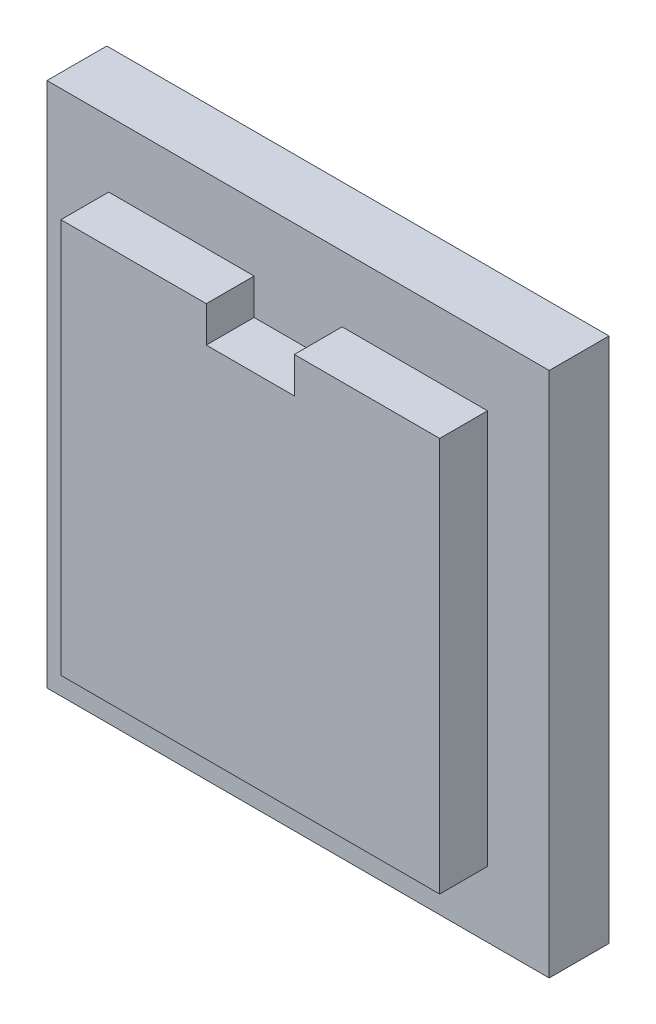
ISO-10303-21;
HEADER;
FILE_DESCRIPTION(('STEP AP214'),'2;1');
FILE_NAME('part.step','',(''),(''),'','','');
FILE_SCHEMA(('AUTOMOTIVE_DESIGN { 1 0 10303 214 1 1 1 1 }'));
ENDSEC;
DATA;
#1=APPLICATION_CONTEXT('core data for automotive mechanical design processes');
#2=APPLICATION_PROTOCOL_DEFINITION('international standard','automotive_design',2000,#1);
#3=PRODUCT_CONTEXT('',#1,'mechanical');
#4=PRODUCT('Part','Part','',(#3));
#5=PRODUCT_RELATED_PRODUCT_CATEGORY('part','',(#4));
#6=PRODUCT_DEFINITION_FORMATION('','',#4);
#7=PRODUCT_DEFINITION_CONTEXT('part definition',#1,'design');
#8=PRODUCT_DEFINITION('design','',#6,#7);
#9=PRODUCT_DEFINITION_SHAPE('','',#8);
#10=(LENGTH_UNIT() NAMED_UNIT(*) SI_UNIT(.MILLI.,.METRE.));
#11=(NAMED_UNIT(*) PLANE_ANGLE_UNIT() SI_UNIT($,.RADIAN.));
#12=(NAMED_UNIT(*) SI_UNIT($,.STERADIAN.) SOLID_ANGLE_UNIT());
#13=UNCERTAINTY_MEASURE_WITH_UNIT(LENGTH_MEASURE(1.E-05),#10,'distance_accuracy_value','');
#14=(GEOMETRIC_REPRESENTATION_CONTEXT(3) GLOBAL_UNCERTAINTY_ASSIGNED_CONTEXT((#13)) GLOBAL_UNIT_ASSIGNED_CONTEXT((#10,
#11,#12)) REPRESENTATION_CONTEXT('',''));
#15=CARTESIAN_POINT('',(0.,0.,0.));
#16=DIRECTION('',(0.,0.,1.));
#17=DIRECTION('',(1.,0.,0.));
#18=AXIS2_PLACEMENT_3D('',#15,#16,#17);
#19=CARTESIAN_POINT('',(5.842,26.19375,6.35));
#20=DIRECTION('',(0.,-1.,0.));
#21=DIRECTION('',(0.,0.,-1.));
#22=AXIS2_PLACEMENT_3D('',#19,#20,#21);
#23=PLANE('',#22);
#24=DIRECTION('',(-1.,0.,0.));
#25=VECTOR('',#24,1.);
#26=CARTESIAN_POINT('',(5.842,26.19375,0.));
#27=LINE('',#26,#25);
#28=CARTESIAN_POINT('',(25.146,26.19375,0.));
#29=VERTEX_POINT('',#28);
#30=CARTESIAN_POINT('',(5.842,26.19375,0.));
#31=VERTEX_POINT('',#30);
#32=EDGE_CURVE('E85',#29,#31,#27,.T.);
#33=ORIENTED_EDGE('',*,*,#32,.T.);
#34=DIRECTION('',(0.,0.,-1.));
#35=VECTOR('',#34,1.);
#36=CARTESIAN_POINT('',(5.842,26.19375,6.35));
#37=LINE('',#36,#35);
#38=CARTESIAN_POINT('',(5.842,26.19375,6.35));
#39=VERTEX_POINT('',#38);
#40=EDGE_CURVE('E11',#39,#31,#37,.T.);
#41=ORIENTED_EDGE('',*,*,#40,.F.);
#42=DIRECTION('',(-1.,0.,0.));
#43=VECTOR('',#42,1.);
#44=CARTESIAN_POINT('',(15.494,26.19375,6.35));
#45=LINE('',#44,#43);
#46=CARTESIAN_POINT('',(25.146,26.19375,6.35));
#47=VERTEX_POINT('',#46);
#48=EDGE_CURVE('E161',#47,#39,#45,.T.);
#49=ORIENTED_EDGE('',*,*,#48,.F.);
#50=DIRECTION('',(0.,0.,-1.));
#51=VECTOR('',#50,1.);
#52=CARTESIAN_POINT('',(25.146,26.19375,6.35));
#53=LINE('',#52,#51);
#54=EDGE_CURVE('E133',#47,#29,#53,.T.);
#55=ORIENTED_EDGE('',*,*,#54,.T.);
#56=EDGE_LOOP('',(#33,#41,#49,#55));
#57=FACE_BOUND('',#56,.T.);
#58=ADVANCED_FACE('F39',(#57),#23,.F.);
#59=CARTESIAN_POINT('',(5.842,21.43125,6.35));
#60=DIRECTION('',(1.,0.,0.));
#61=DIRECTION('',(0.,1.,0.));
#62=AXIS2_PLACEMENT_3D('',#59,#60,#61);
#63=PLANE('',#62);
#64=DIRECTION('',(0.,-1.,0.));
#65=VECTOR('',#64,1.);
#66=CARTESIAN_POINT('',(5.842,21.43125,0.));
#67=LINE('',#66,#65);
#68=CARTESIAN_POINT('',(5.842,21.43125,0.));
#69=VERTEX_POINT('',#68);
#70=EDGE_CURVE('E139',#31,#69,#67,.T.);
#71=ORIENTED_EDGE('',*,*,#70,.T.);
#72=DIRECTION('',(0.,0.,-1.));
#73=VECTOR('',#72,1.);
#74=CARTESIAN_POINT('',(5.842,21.43125,6.35));
#75=LINE('',#74,#73);
#76=CARTESIAN_POINT('',(5.842,21.43125,6.35));
#77=VERTEX_POINT('',#76);
#78=EDGE_CURVE('E47',#77,#69,#75,.T.);
#79=ORIENTED_EDGE('',*,*,#78,.F.);
#80=DIRECTION('',(0.,-1.,0.));
#81=VECTOR('',#80,1.);
#82=CARTESIAN_POINT('',(5.842,21.43125,6.35));
#83=LINE('',#82,#81);
#84=EDGE_CURVE('E188',#39,#77,#83,.T.);
#85=ORIENTED_EDGE('',*,*,#84,.F.);
#86=ORIENTED_EDGE('',*,*,#40,.T.);
#87=EDGE_LOOP('',(#71,#79,#85,#86));
#88=FACE_BOUND('',#87,.T.);
#89=ADVANCED_FACE('F187',(#88),#63,.F.);
#90=CARTESIAN_POINT('',(-5.842,21.43125,6.35));
#91=DIRECTION('',(0.,-1.,0.));
#92=DIRECTION('',(0.,0.,-1.));
#93=AXIS2_PLACEMENT_3D('',#90,#91,#92);
#94=PLANE('',#93);
#95=DIRECTION('',(-1.,0.,0.));
#96=VECTOR('',#95,1.);
#97=CARTESIAN_POINT('',(-5.842,21.43125,0.));
#98=LINE('',#97,#96);
#99=CARTESIAN_POINT('',(-5.842,21.43125,0.));
#100=VERTEX_POINT('',#99);
#101=EDGE_CURVE('E76',#69,#100,#98,.T.);
#102=ORIENTED_EDGE('',*,*,#101,.T.);
#103=DIRECTION('',(0.,0.,-1.));
#104=VECTOR('',#103,1.);
#105=CARTESIAN_POINT('',(-5.842,21.43125,6.35));
#106=LINE('',#105,#104);
#107=CARTESIAN_POINT('',(-5.842,21.43125,6.35));
#108=VERTEX_POINT('',#107);
#109=EDGE_CURVE('E173',#108,#100,#106,.T.);
#110=ORIENTED_EDGE('',*,*,#109,.F.);
#111=DIRECTION('',(-1.,0.,0.));
#112=VECTOR('',#111,1.);
#113=CARTESIAN_POINT('',(-5.842,21.43125,6.35));
#114=LINE('',#113,#112);
#115=EDGE_CURVE('E184',#77,#108,#114,.T.);
#116=ORIENTED_EDGE('',*,*,#115,.F.);
#117=ORIENTED_EDGE('',*,*,#78,.T.);
#118=EDGE_LOOP('',(#102,#110,#116,#117));
#119=FACE_BOUND('',#118,.T.);
#120=ADVANCED_FACE('F181',(#119),#94,.F.);
#121=CARTESIAN_POINT('',(-5.842,26.19375,6.35));
#122=DIRECTION('',(-1.,0.,0.));
#123=DIRECTION('',(0.,-1.,0.));
#124=AXIS2_PLACEMENT_3D('',#121,#122,#123);
#125=PLANE('',#124);
#126=DIRECTION('',(0.,1.,0.));
#127=VECTOR('',#126,1.);
#128=CARTESIAN_POINT('',(-5.842,26.19375,0.));
#129=LINE('',#128,#127);
#130=CARTESIAN_POINT('',(-5.842,26.19375,0.));
#131=VERTEX_POINT('',#130);
#132=EDGE_CURVE('E145',#100,#131,#129,.T.);
#133=ORIENTED_EDGE('',*,*,#132,.T.);
#134=DIRECTION('',(0.,0.,-1.));
#135=VECTOR('',#134,1.);
#136=CARTESIAN_POINT('',(-5.842,26.19375,6.35));
#137=LINE('',#136,#135);
#138=CARTESIAN_POINT('',(-5.842,26.19375,6.35));
#139=VERTEX_POINT('',#138);
#140=EDGE_CURVE('E169',#139,#131,#137,.T.);
#141=ORIENTED_EDGE('',*,*,#140,.F.);
#142=DIRECTION('',(0.,1.,0.));
#143=VECTOR('',#142,1.);
#144=CARTESIAN_POINT('',(-5.842,26.19375,6.35));
#145=LINE('',#144,#143);
#146=EDGE_CURVE('E417',#108,#139,#145,.T.);
#147=ORIENTED_EDGE('',*,*,#146,.F.);
#148=ORIENTED_EDGE('',*,*,#109,.T.);
#149=EDGE_LOOP('',(#133,#141,#147,#148));
#150=FACE_BOUND('',#149,.T.);
#151=ADVANCED_FACE('F423',(#150),#125,.F.);
#152=CARTESIAN_POINT('',(-25.146,26.19375,6.35));
#153=DIRECTION('',(0.,-1.,0.));
#154=DIRECTION('',(0.,0.,-1.));
#155=AXIS2_PLACEMENT_3D('',#152,#153,#154);
#156=PLANE('',#155);
#157=DIRECTION('',(-1.,0.,0.));
#158=VECTOR('',#157,1.);
#159=CARTESIAN_POINT('',(-25.146,26.19375,0.));
#160=LINE('',#159,#158);
#161=CARTESIAN_POINT('',(-25.146,26.19375,0.));
#162=VERTEX_POINT('',#161);
#163=EDGE_CURVE('E149',#131,#162,#160,.T.);
#164=ORIENTED_EDGE('',*,*,#163,.T.);
#165=DIRECTION('',(0.,0.,-1.));
#166=VECTOR('',#165,1.);
#167=CARTESIAN_POINT('',(-25.146,26.19375,6.35));
#168=LINE('',#167,#166);
#169=CARTESIAN_POINT('',(-25.146,26.19375,6.35));
#170=VERTEX_POINT('',#169);
#171=EDGE_CURVE('E125',#170,#162,#168,.T.);
#172=ORIENTED_EDGE('',*,*,#171,.F.);
#173=DIRECTION('',(-1.,0.,0.));
#174=VECTOR('',#173,1.);
#175=CARTESIAN_POINT('',(-15.494,26.19375,6.35));
#176=LINE('',#175,#174);
#177=EDGE_CURVE('E110',#139,#170,#176,.T.);
#178=ORIENTED_EDGE('',*,*,#177,.F.);
#179=ORIENTED_EDGE('',*,*,#140,.T.);
#180=EDGE_LOOP('',(#164,#172,#178,#179));
#181=FACE_BOUND('',#180,.T.);
#182=ADVANCED_FACE('F425',(#181),#156,.F.);
#183=CARTESIAN_POINT('',(-25.146,-26.19375,6.35));
#184=DIRECTION('',(1.,0.,0.));
#185=DIRECTION('',(0.,0.,-1.));
#186=AXIS2_PLACEMENT_3D('',#183,#184,#185);
#187=PLANE('',#186);
#188=DIRECTION('',(0.,-1.,0.));
#189=VECTOR('',#188,1.);
#190=CARTESIAN_POINT('',(-25.146,-26.19375,0.));
#191=LINE('',#190,#189);
#192=CARTESIAN_POINT('',(-25.146,-26.19375,0.));
#193=VERTEX_POINT('',#192);
#194=EDGE_CURVE('E121',#162,#193,#191,.T.);
#195=ORIENTED_EDGE('',*,*,#194,.T.);
#196=DIRECTION('',(0.,0.,-1.));
#197=VECTOR('',#196,1.);
#198=CARTESIAN_POINT('',(-25.146,-26.19375,6.35));
#199=LINE('',#198,#197);
#200=CARTESIAN_POINT('',(-25.146,-26.19375,6.35));
#201=VERTEX_POINT('',#200);
#202=EDGE_CURVE('E118',#201,#193,#199,.T.);
#203=ORIENTED_EDGE('',*,*,#202,.F.);
#204=DIRECTION('',(0.,-1.,0.));
#205=VECTOR('',#204,1.);
#206=CARTESIAN_POINT('',(-25.146,-26.19375,6.35));
#207=LINE('',#206,#205);
#208=EDGE_CURVE('E103',#170,#201,#207,.T.);
#209=ORIENTED_EDGE('',*,*,#208,.F.);
#210=ORIENTED_EDGE('',*,*,#171,.T.);
#211=EDGE_LOOP('',(#195,#203,#209,#210));
#212=FACE_BOUND('',#211,.T.);
#213=ADVANCED_FACE('F119',(#212),#187,.F.);
#214=CARTESIAN_POINT('',(-25.146,-26.19375,6.35));
#215=DIRECTION('',(0.,1.,0.));
#216=DIRECTION('',(0.,0.,1.));
#217=AXIS2_PLACEMENT_3D('',#214,#215,#216);
#218=PLANE('',#217);
#219=DIRECTION('',(1.,0.,0.));
#220=VECTOR('',#219,1.);
#221=CARTESIAN_POINT('',(-25.146,-26.19375,0.));
#222=LINE('',#221,#220);
#223=CARTESIAN_POINT('',(25.146,-26.19375,0.));
#224=VERTEX_POINT('',#223);
#225=EDGE_CURVE('E155',#193,#224,#222,.T.);
#226=ORIENTED_EDGE('',*,*,#225,.T.);
#227=DIRECTION('',(0.,0.,-1.));
#228=VECTOR('',#227,1.);
#229=CARTESIAN_POINT('',(25.146,-26.19375,6.35));
#230=LINE('',#229,#228);
#231=CARTESIAN_POINT('',(25.146,-26.19375,6.35));
#232=VERTEX_POINT('',#231);
#233=EDGE_CURVE('E126',#232,#224,#230,.T.);
#234=ORIENTED_EDGE('',*,*,#233,.F.);
#235=DIRECTION('',(1.,0.,0.));
#236=VECTOR('',#235,1.);
#237=CARTESIAN_POINT('',(-25.146,-26.19375,6.35));
#238=LINE('',#237,#236);
#239=EDGE_CURVE('E107',#201,#232,#238,.T.);
#240=ORIENTED_EDGE('',*,*,#239,.F.);
#241=ORIENTED_EDGE('',*,*,#202,.T.);
#242=EDGE_LOOP('',(#226,#234,#240,#241));
#243=FACE_BOUND('',#242,.T.);
#244=ADVANCED_FACE('F128',(#243),#218,.F.);
#245=CARTESIAN_POINT('',(25.146,-26.19375,6.35));
#246=DIRECTION('',(-1.,0.,0.));
#247=DIRECTION('',(0.,0.,1.));
#248=AXIS2_PLACEMENT_3D('',#245,#246,#247);
#249=PLANE('',#248);
#250=DIRECTION('',(0.,1.,0.));
#251=VECTOR('',#250,1.);
#252=CARTESIAN_POINT('',(25.146,-26.19375,0.));
#253=LINE('',#252,#251);
#254=EDGE_CURVE('E158',#224,#29,#253,.T.);
#255=ORIENTED_EDGE('',*,*,#254,.T.);
#256=ORIENTED_EDGE('',*,*,#54,.F.);
#257=DIRECTION('',(0.,1.,0.));
#258=VECTOR('',#257,1.);
#259=CARTESIAN_POINT('',(25.146,-26.19375,6.35));
#260=LINE('',#259,#258);
#261=EDGE_CURVE('E63',#232,#47,#260,.T.);
#262=ORIENTED_EDGE('',*,*,#261,.F.);
#263=ORIENTED_EDGE('',*,*,#233,.T.);
#264=EDGE_LOOP('',(#255,#256,#262,#263));
#265=FACE_BOUND('',#264,.T.);
#266=ADVANCED_FACE('F197',(#265),#249,.F.);
#267=CARTESIAN_POINT('',(0.,0.,6.35));
#268=DIRECTION('',(0.,0.,1.));
#269=DIRECTION('',(1.,0.,0.));
#270=AXIS2_PLACEMENT_3D('',#267,#268,#269);
#271=PLANE('',#270);
#272=ORIENTED_EDGE('',*,*,#48,.T.);
#273=ORIENTED_EDGE('',*,*,#84,.T.);
#274=ORIENTED_EDGE('',*,*,#115,.T.);
#275=ORIENTED_EDGE('',*,*,#146,.T.);
#276=ORIENTED_EDGE('',*,*,#177,.T.);
#277=ORIENTED_EDGE('',*,*,#208,.T.);
#278=ORIENTED_EDGE('',*,*,#239,.T.);
#279=ORIENTED_EDGE('',*,*,#261,.T.);
#280=EDGE_LOOP('',(#272,#273,#274,#275,#276,#277,#278,#279));
#281=FACE_BOUND('',#280,.T.);
#282=ADVANCED_FACE('F105',(#281),#271,.T.);
#283=CARTESIAN_POINT('',(0.,0.,0.));
#284=DIRECTION('',(0.,0.,1.));
#285=DIRECTION('',(1.,0.,0.));
#286=AXIS2_PLACEMENT_3D('',#283,#284,#285);
#287=PLANE('',#286);
#288=DIRECTION('',(0.,-1.,0.));
#289=VECTOR('',#288,1.);
#290=CARTESIAN_POINT('',(-33.3375,-34.925,0.));
#291=LINE('',#290,#289);
#292=CARTESIAN_POINT('',(-33.3375,34.925,0.));
#293=VERTEX_POINT('',#292);
#294=CARTESIAN_POINT('',(-33.3375,-34.925,0.));
#295=VERTEX_POINT('',#294);
#296=EDGE_CURVE('E384',#293,#295,#291,.T.);
#297=ORIENTED_EDGE('',*,*,#296,.T.);
#298=DIRECTION('',(1.,0.,0.));
#299=VECTOR('',#298,1.);
#300=CARTESIAN_POINT('',(33.3375,-34.925,0.));
#301=LINE('',#300,#299);
#302=CARTESIAN_POINT('',(33.3375,-34.925,0.));
#303=VERTEX_POINT('',#302);
#304=EDGE_CURVE('E388',#295,#303,#301,.T.);
#305=ORIENTED_EDGE('',*,*,#304,.T.);
#306=DIRECTION('',(0.,1.,0.));
#307=VECTOR('',#306,1.);
#308=CARTESIAN_POINT('',(33.3375,-34.925,0.));
#309=LINE('',#308,#307);
#310=CARTESIAN_POINT('',(33.3375,34.925,0.));
#311=VERTEX_POINT('',#310);
#312=EDGE_CURVE('E392',#303,#311,#309,.T.);
#313=ORIENTED_EDGE('',*,*,#312,.T.);
#314=DIRECTION('',(-1.,0.,0.));
#315=VECTOR('',#314,1.);
#316=CARTESIAN_POINT('',(33.3375,34.925,0.));
#317=LINE('',#316,#315);
#318=EDGE_CURVE('E396',#311,#293,#317,.T.);
#319=ORIENTED_EDGE('',*,*,#318,.T.);
#320=EDGE_LOOP('',(#297,#305,#313,#319));
#321=FACE_BOUND('',#320,.T.);
#322=ORIENTED_EDGE('',*,*,#32,.F.);
#323=ORIENTED_EDGE('',*,*,#254,.F.);
#324=ORIENTED_EDGE('',*,*,#225,.F.);
#325=ORIENTED_EDGE('',*,*,#194,.F.);
#326=ORIENTED_EDGE('',*,*,#163,.F.);
#327=ORIENTED_EDGE('',*,*,#132,.F.);
#328=ORIENTED_EDGE('',*,*,#101,.F.);
#329=ORIENTED_EDGE('',*,*,#70,.F.);
#330=EDGE_LOOP('',(#322,#323,#324,#325,#326,#327,#328,#329));
#331=FACE_BOUND('',#330,.T.);
#332=ADVANCED_FACE('F191',(#321,#331),#287,.T.);
#333=CARTESIAN_POINT('',(-33.3375,-34.925,-3.175));
#334=DIRECTION('',(-1.,0.,0.));
#335=DIRECTION('',(0.,0.,1.));
#336=AXIS2_PLACEMENT_3D('',#333,#334,#335);
#337=PLANE('',#336);
#338=ORIENTED_EDGE('',*,*,#296,.F.);
#339=DIRECTION('',(0.,0.,1.));
#340=VECTOR('',#339,1.);
#341=CARTESIAN_POINT('',(-33.3375,34.925,-3.175));
#342=LINE('',#341,#340);
#343=CARTESIAN_POINT('',(-33.3375,34.925,-7.9375));
#344=VERTEX_POINT('',#343);
#345=EDGE_CURVE('E140',#344,#293,#342,.T.);
#346=ORIENTED_EDGE('',*,*,#345,.F.);
#347=DIRECTION('',(0.,1.,0.));
#348=VECTOR('',#347,1.);
#349=CARTESIAN_POINT('',(-33.3375,-34.925,-7.9375));
#350=LINE('',#349,#348);
#351=CARTESIAN_POINT('',(-33.3375,-34.925,-7.9375));
#352=VERTEX_POINT('',#351);
#353=EDGE_CURVE('E372',#352,#344,#350,.T.);
#354=ORIENTED_EDGE('',*,*,#353,.F.);
#355=DIRECTION('',(0.,0.,1.));
#356=VECTOR('',#355,1.);
#357=CARTESIAN_POINT('',(-33.3375,-34.925,-3.175));
#358=LINE('',#357,#356);
#359=EDGE_CURVE('E400',#352,#295,#358,.T.);
#360=ORIENTED_EDGE('',*,*,#359,.T.);
#361=EDGE_LOOP('',(#338,#346,#354,#360));
#362=FACE_BOUND('',#361,.T.);
#363=ADVANCED_FACE('F486',(#362),#337,.T.);
#364=CARTESIAN_POINT('',(33.3375,34.925,-3.175));
#365=DIRECTION('',(0.,1.,0.));
#366=DIRECTION('',(-1.,0.,0.));
#367=AXIS2_PLACEMENT_3D('',#364,#365,#366);
#368=PLANE('',#367);
#369=ORIENTED_EDGE('',*,*,#318,.F.);
#370=DIRECTION('',(0.,0.,1.));
#371=VECTOR('',#370,1.);
#372=CARTESIAN_POINT('',(33.3375,34.925,-3.175));
#373=LINE('',#372,#371);
#374=CARTESIAN_POINT('',(33.3375,34.925,-7.9375));
#375=VERTEX_POINT('',#374);
#376=EDGE_CURVE('E403',#375,#311,#373,.T.);
#377=ORIENTED_EDGE('',*,*,#376,.F.);
#378=DIRECTION('',(1.,0.,0.));
#379=VECTOR('',#378,1.);
#380=CARTESIAN_POINT('',(-33.3375,34.925,-7.9375));
#381=LINE('',#380,#379);
#382=EDGE_CURVE('E376',#344,#375,#381,.T.);
#383=ORIENTED_EDGE('',*,*,#382,.F.);
#384=ORIENTED_EDGE('',*,*,#345,.T.);
#385=EDGE_LOOP('',(#369,#377,#383,#384));
#386=FACE_BOUND('',#385,.T.);
#387=ADVANCED_FACE('F497',(#386),#368,.T.);
#388=CARTESIAN_POINT('',(33.3375,-34.925,-3.175));
#389=DIRECTION('',(1.,0.,0.));
#390=DIRECTION('',(0.,0.,-1.));
#391=AXIS2_PLACEMENT_3D('',#388,#389,#390);
#392=PLANE('',#391);
#393=ORIENTED_EDGE('',*,*,#312,.F.);
#394=DIRECTION('',(0.,0.,1.));
#395=VECTOR('',#394,1.);
#396=CARTESIAN_POINT('',(33.3375,-34.925,-3.175));
#397=LINE('',#396,#395);
#398=CARTESIAN_POINT('',(33.3375,-34.925,-7.9375));
#399=VERTEX_POINT('',#398);
#400=EDGE_CURVE('E406',#399,#303,#397,.T.);
#401=ORIENTED_EDGE('',*,*,#400,.F.);
#402=DIRECTION('',(0.,-1.,0.));
#403=VECTOR('',#402,1.);
#404=CARTESIAN_POINT('',(33.3375,34.925,-7.9375));
#405=LINE('',#404,#403);
#406=EDGE_CURVE('E380',#375,#399,#405,.T.);
#407=ORIENTED_EDGE('',*,*,#406,.F.);
#408=ORIENTED_EDGE('',*,*,#376,.T.);
#409=EDGE_LOOP('',(#393,#401,#407,#408));
#410=FACE_BOUND('',#409,.T.);
#411=ADVANCED_FACE('F508',(#410),#392,.T.);
#412=CARTESIAN_POINT('',(33.3375,-34.925,-3.175));
#413=DIRECTION('',(0.,-1.,0.));
#414=DIRECTION('',(1.,0.,0.));
#415=AXIS2_PLACEMENT_3D('',#412,#413,#414);
#416=PLANE('',#415);
#417=ORIENTED_EDGE('',*,*,#304,.F.);
#418=ORIENTED_EDGE('',*,*,#359,.F.);
#419=DIRECTION('',(-1.,0.,0.));
#420=VECTOR('',#419,1.);
#421=CARTESIAN_POINT('',(33.3375,-34.925,-7.9375));
#422=LINE('',#421,#420);
#423=EDGE_CURVE('E293',#399,#352,#422,.T.);
#424=ORIENTED_EDGE('',*,*,#423,.F.);
#425=ORIENTED_EDGE('',*,*,#400,.T.);
#426=EDGE_LOOP('',(#417,#418,#424,#425));
#427=FACE_BOUND('',#426,.T.);
#428=ADVANCED_FACE('F519',(#427),#416,.T.);
#429=CARTESIAN_POINT('',(0.,0.,-7.9375));
#430=DIRECTION('',(0.,0.,-1.));
#431=DIRECTION('',(-1.,0.,0.));
#432=AXIS2_PLACEMENT_3D('',#429,#430,#431);
#433=PLANE('',#432);
#434=ORIENTED_EDGE('',*,*,#423,.T.);
#435=ORIENTED_EDGE('',*,*,#353,.T.);
#436=ORIENTED_EDGE('',*,*,#382,.T.);
#437=ORIENTED_EDGE('',*,*,#406,.T.);
#438=EDGE_LOOP('',(#434,#435,#436,#437));
#439=FACE_BOUND('',#438,.T.);
#440=DIRECTION('',(-1.,0.,0.));
#441=VECTOR('',#440,1.);
#442=CARTESIAN_POINT('',(5.715,-22.733,-7.9375));
#443=LINE('',#442,#441);
#444=CARTESIAN_POINT('',(5.715,-22.733,-7.9375));
#445=VERTEX_POINT('',#444);
#446=CARTESIAN_POINT('',(-5.715,-22.733,-7.9375));
#447=VERTEX_POINT('',#446);
#448=EDGE_CURVE('E284',#445,#447,#443,.T.);
#449=ORIENTED_EDGE('',*,*,#448,.F.);
#450=DIRECTION('',(0.,1.,0.));
#451=VECTOR('',#450,1.);
#452=CARTESIAN_POINT('',(5.715,-27.305,-7.9375));
#453=LINE('',#452,#451);
#454=CARTESIAN_POINT('',(5.715,-27.305,-7.9375));
#455=VERTEX_POINT('',#454);
#456=EDGE_CURVE('E275',#455,#445,#453,.T.);
#457=ORIENTED_EDGE('',*,*,#456,.F.);
#458=DIRECTION('',(-1.,0.,0.));
#459=VECTOR('',#458,1.);
#460=CARTESIAN_POINT('',(24.892,-27.305,-7.9375));
#461=LINE('',#460,#459);
#462=CARTESIAN_POINT('',(24.892,-27.305,-7.9375));
#463=VERTEX_POINT('',#462);
#464=EDGE_CURVE('E318',#463,#455,#461,.T.);
#465=ORIENTED_EDGE('',*,*,#464,.F.);
#466=DIRECTION('',(0.,-1.,0.));
#467=VECTOR('',#466,1.);
#468=CARTESIAN_POINT('',(24.892,-27.305,-7.9375));
#469=LINE('',#468,#467);
#470=CARTESIAN_POINT('',(24.892,27.305,-7.9375));
#471=VERTEX_POINT('',#470);
#472=EDGE_CURVE('E314',#471,#463,#469,.T.);
#473=ORIENTED_EDGE('',*,*,#472,.F.);
#474=DIRECTION('',(1.,0.,0.));
#475=VECTOR('',#474,1.);
#476=CARTESIAN_POINT('',(-5.715,27.305,-7.9375));
#477=LINE('',#476,#475);
#478=CARTESIAN_POINT('',(-24.892,27.305,-7.9375));
#479=VERTEX_POINT('',#478);
#480=EDGE_CURVE('E311',#479,#471,#477,.T.);
#481=ORIENTED_EDGE('',*,*,#480,.F.);
#482=DIRECTION('',(0.,1.,0.));
#483=VECTOR('',#482,1.);
#484=CARTESIAN_POINT('',(-24.892,-27.305,-7.9375));
#485=LINE('',#484,#483);
#486=CARTESIAN_POINT('',(-24.892,-27.305,-7.9375));
#487=VERTEX_POINT('',#486);
#488=EDGE_CURVE('E308',#487,#479,#485,.T.);
#489=ORIENTED_EDGE('',*,*,#488,.F.);
#490=DIRECTION('',(-1.,0.,0.));
#491=VECTOR('',#490,1.);
#492=CARTESIAN_POINT('',(-5.715,-27.305,-7.9375));
#493=LINE('',#492,#491);
#494=CARTESIAN_POINT('',(-5.715,-27.305,-7.9375));
#495=VERTEX_POINT('',#494);
#496=EDGE_CURVE('E303',#495,#487,#493,.T.);
#497=ORIENTED_EDGE('',*,*,#496,.F.);
#498=DIRECTION('',(0.,-1.,0.));
#499=VECTOR('',#498,1.);
#500=CARTESIAN_POINT('',(-5.715,-27.305,-7.9375));
#501=LINE('',#500,#499);
#502=EDGE_CURVE('E299',#447,#495,#501,.T.);
#503=ORIENTED_EDGE('',*,*,#502,.F.);
#504=EDGE_LOOP('',(#449,#457,#465,#473,#481,#489,#497,#503));
#505=FACE_BOUND('',#504,.T.);
#506=ADVANCED_FACE('F297',(#439,#505),#433,.T.);
#507=CARTESIAN_POINT('',(5.715,-27.305,-7.9375));
#508=DIRECTION('',(1.,0.,0.));
#509=DIRECTION('',(0.,0.,-1.));
#510=AXIS2_PLACEMENT_3D('',#507,#508,#509);
#511=PLANE('',#510);
#512=DIRECTION('',(0.,1.,0.));
#513=VECTOR('',#512,1.);
#514=CARTESIAN_POINT('',(5.715,-27.305,-3.175));
#515=LINE('',#514,#513);
#516=CARTESIAN_POINT('',(5.715,-27.305,-3.175));
#517=VERTEX_POINT('',#516);
#518=CARTESIAN_POINT('',(5.715,-22.733,-3.175));
#519=VERTEX_POINT('',#518);
#520=EDGE_CURVE('E321',#517,#519,#515,.T.);
#521=ORIENTED_EDGE('',*,*,#520,.F.);
#522=DIRECTION('',(0.,0.,1.));
#523=VECTOR('',#522,1.);
#524=CARTESIAN_POINT('',(5.715,-27.305,-7.9375));
#525=LINE('',#524,#523);
#526=EDGE_CURVE('E54',#455,#517,#525,.T.);
#527=ORIENTED_EDGE('',*,*,#526,.F.);
#528=ORIENTED_EDGE('',*,*,#456,.T.);
#529=DIRECTION('',(0.,0.,1.));
#530=VECTOR('',#529,1.);
#531=CARTESIAN_POINT('',(5.715,-22.733,-7.9375));
#532=LINE('',#531,#530);
#533=EDGE_CURVE('E278',#445,#519,#532,.T.);
#534=ORIENTED_EDGE('',*,*,#533,.T.);
#535=EDGE_LOOP('',(#521,#527,#528,#534));
#536=FACE_BOUND('',#535,.T.);
#537=ADVANCED_FACE('F277',(#536),#511,.T.);
#538=CARTESIAN_POINT('',(5.715,-22.733,-7.9375));
#539=DIRECTION('',(0.,1.,0.));
#540=DIRECTION('',(0.,0.,1.));
#541=AXIS2_PLACEMENT_3D('',#538,#539,#540);
#542=PLANE('',#541);
#543=DIRECTION('',(-1.,0.,0.));
#544=VECTOR('',#543,1.);
#545=CARTESIAN_POINT('',(5.715,-22.733,-3.175));
#546=LINE('',#545,#544);
#547=CARTESIAN_POINT('',(-5.715,-22.733,-3.175));
#548=VERTEX_POINT('',#547);
#549=EDGE_CURVE('E291',#519,#548,#546,.T.);
#550=ORIENTED_EDGE('',*,*,#549,.F.);
#551=ORIENTED_EDGE('',*,*,#533,.F.);
#552=ORIENTED_EDGE('',*,*,#448,.T.);
#553=DIRECTION('',(0.,0.,1.));
#554=VECTOR('',#553,1.);
#555=CARTESIAN_POINT('',(-5.715,-22.733,-7.9375));
#556=LINE('',#555,#554);
#557=EDGE_CURVE('E294',#447,#548,#556,.T.);
#558=ORIENTED_EDGE('',*,*,#557,.T.);
#559=EDGE_LOOP('',(#550,#551,#552,#558));
#560=FACE_BOUND('',#559,.T.);
#561=ADVANCED_FACE('F288',(#560),#542,.T.);
#562=CARTESIAN_POINT('',(-5.715,-27.305,-7.9375));
#563=DIRECTION('',(-1.,0.,0.));
#564=DIRECTION('',(0.,-1.,0.));
#565=AXIS2_PLACEMENT_3D('',#562,#563,#564);
#566=PLANE('',#565);
#567=DIRECTION('',(0.,-1.,0.));
#568=VECTOR('',#567,1.);
#569=CARTESIAN_POINT('',(-5.715,-27.305,-3.175));
#570=LINE('',#569,#568);
#571=CARTESIAN_POINT('',(-5.715,-27.305,-3.175));
#572=VERTEX_POINT('',#571);
#573=EDGE_CURVE('E326',#548,#572,#570,.T.);
#574=ORIENTED_EDGE('',*,*,#573,.F.);
#575=ORIENTED_EDGE('',*,*,#557,.F.);
#576=ORIENTED_EDGE('',*,*,#502,.T.);
#577=DIRECTION('',(0.,0.,1.));
#578=VECTOR('',#577,1.);
#579=CARTESIAN_POINT('',(-5.715,-27.305,-7.9375));
#580=LINE('',#579,#578);
#581=EDGE_CURVE('E364',#495,#572,#580,.T.);
#582=ORIENTED_EDGE('',*,*,#581,.T.);
#583=EDGE_LOOP('',(#574,#575,#576,#582));
#584=FACE_BOUND('',#583,.T.);
#585=ADVANCED_FACE('F557',(#584),#566,.T.);
#586=CARTESIAN_POINT('',(-5.715,-27.305,-7.9375));
#587=DIRECTION('',(0.,1.,0.));
#588=DIRECTION('',(0.,0.,1.));
#589=AXIS2_PLACEMENT_3D('',#586,#587,#588);
#590=PLANE('',#589);
#591=DIRECTION('',(-1.,0.,0.));
#592=VECTOR('',#591,1.);
#593=CARTESIAN_POINT('',(-5.715,-27.305,-3.175));
#594=LINE('',#593,#592);
#595=CARTESIAN_POINT('',(-24.892,-27.305,-3.175));
#596=VERTEX_POINT('',#595);
#597=EDGE_CURVE('E330',#572,#596,#594,.T.);
#598=ORIENTED_EDGE('',*,*,#597,.F.);
#599=ORIENTED_EDGE('',*,*,#581,.F.);
#600=ORIENTED_EDGE('',*,*,#496,.T.);
#601=DIRECTION('',(0.,0.,1.));
#602=VECTOR('',#601,1.);
#603=CARTESIAN_POINT('',(-24.892,-27.305,-7.9375));
#604=LINE('',#603,#602);
#605=EDGE_CURVE('E361',#487,#596,#604,.T.);
#606=ORIENTED_EDGE('',*,*,#605,.T.);
#607=EDGE_LOOP('',(#598,#599,#600,#606));
#608=FACE_BOUND('',#607,.T.);
#609=ADVANCED_FACE('F566',(#608),#590,.T.);
#610=CARTESIAN_POINT('',(-24.892,-27.305,-7.9375));
#611=DIRECTION('',(1.,0.,0.));
#612=DIRECTION('',(0.,0.,-1.));
#613=AXIS2_PLACEMENT_3D('',#610,#611,#612);
#614=PLANE('',#613);
#615=DIRECTION('',(0.,1.,0.));
#616=VECTOR('',#615,1.);
#617=CARTESIAN_POINT('',(-24.892,-27.305,-3.175));
#618=LINE('',#617,#616);
#619=CARTESIAN_POINT('',(-24.892,27.305,-3.175));
#620=VERTEX_POINT('',#619);
#621=EDGE_CURVE('E334',#596,#620,#618,.T.);
#622=ORIENTED_EDGE('',*,*,#621,.F.);
#623=ORIENTED_EDGE('',*,*,#605,.F.);
#624=ORIENTED_EDGE('',*,*,#488,.T.);
#625=DIRECTION('',(0.,0.,1.));
#626=VECTOR('',#625,1.);
#627=CARTESIAN_POINT('',(-24.892,27.305,-7.9375));
#628=LINE('',#627,#626);
#629=EDGE_CURVE('E357',#479,#620,#628,.T.);
#630=ORIENTED_EDGE('',*,*,#629,.T.);
#631=EDGE_LOOP('',(#622,#623,#624,#630));
#632=FACE_BOUND('',#631,.T.);
#633=ADVANCED_FACE('F576',(#632),#614,.T.);
#634=CARTESIAN_POINT('',(24.892,27.305,-7.9375));
#635=DIRECTION('',(0.,-1.,0.));
#636=DIRECTION('',(0.,0.,-1.));
#637=AXIS2_PLACEMENT_3D('',#634,#635,#636);
#638=PLANE('',#637);
#639=DIRECTION('',(1.,0.,0.));
#640=VECTOR('',#639,1.);
#641=CARTESIAN_POINT('',(24.892,27.305,-3.175));
#642=LINE('',#641,#640);
#643=CARTESIAN_POINT('',(24.892,27.305,-3.175));
#644=VERTEX_POINT('',#643);
#645=EDGE_CURVE('E338',#620,#644,#642,.T.);
#646=ORIENTED_EDGE('',*,*,#645,.F.);
#647=ORIENTED_EDGE('',*,*,#629,.F.);
#648=ORIENTED_EDGE('',*,*,#480,.T.);
#649=DIRECTION('',(0.,0.,1.));
#650=VECTOR('',#649,1.);
#651=CARTESIAN_POINT('',(24.892,27.305,-7.9375));
#652=LINE('',#651,#650);
#653=EDGE_CURVE('E354',#471,#644,#652,.T.);
#654=ORIENTED_EDGE('',*,*,#653,.T.);
#655=EDGE_LOOP('',(#646,#647,#648,#654));
#656=FACE_BOUND('',#655,.T.);
#657=ADVANCED_FACE('F586',(#656),#638,.T.);
#658=CARTESIAN_POINT('',(24.892,-27.305,-7.9375));
#659=DIRECTION('',(-1.,0.,0.));
#660=DIRECTION('',(0.,0.,1.));
#661=AXIS2_PLACEMENT_3D('',#658,#659,#660);
#662=PLANE('',#661);
#663=DIRECTION('',(0.,-1.,0.));
#664=VECTOR('',#663,1.);
#665=CARTESIAN_POINT('',(24.892,-27.305,-3.175));
#666=LINE('',#665,#664);
#667=CARTESIAN_POINT('',(24.892,-27.305,-3.175));
#668=VERTEX_POINT('',#667);
#669=EDGE_CURVE('E342',#644,#668,#666,.T.);
#670=ORIENTED_EDGE('',*,*,#669,.F.);
#671=ORIENTED_EDGE('',*,*,#653,.F.);
#672=ORIENTED_EDGE('',*,*,#472,.T.);
#673=DIRECTION('',(0.,0.,1.));
#674=VECTOR('',#673,1.);
#675=CARTESIAN_POINT('',(24.892,-27.305,-7.9375));
#676=LINE('',#675,#674);
#677=EDGE_CURVE('E351',#463,#668,#676,.T.);
#678=ORIENTED_EDGE('',*,*,#677,.T.);
#679=EDGE_LOOP('',(#670,#671,#672,#678));
#680=FACE_BOUND('',#679,.T.);
#681=ADVANCED_FACE('F597',(#680),#662,.T.);
#682=CARTESIAN_POINT('',(24.892,-27.305,-7.9375));
#683=DIRECTION('',(0.,1.,0.));
#684=DIRECTION('',(0.,0.,1.));
#685=AXIS2_PLACEMENT_3D('',#682,#683,#684);
#686=PLANE('',#685);
#687=DIRECTION('',(-1.,0.,0.));
#688=VECTOR('',#687,1.);
#689=CARTESIAN_POINT('',(24.892,-27.305,-3.175));
#690=LINE('',#689,#688);
#691=EDGE_CURVE('E285',#668,#517,#690,.T.);
#692=ORIENTED_EDGE('',*,*,#691,.F.);
#693=ORIENTED_EDGE('',*,*,#677,.F.);
#694=ORIENTED_EDGE('',*,*,#464,.T.);
#695=ORIENTED_EDGE('',*,*,#526,.T.);
#696=EDGE_LOOP('',(#692,#693,#694,#695));
#697=FACE_BOUND('',#696,.T.);
#698=ADVANCED_FACE('F608',(#697),#686,.T.);
#699=CARTESIAN_POINT('',(0.,0.,-3.175));
#700=DIRECTION('',(0.,0.,1.));
#701=DIRECTION('',(1.,0.,0.));
#702=AXIS2_PLACEMENT_3D('',#699,#700,#701);
#703=PLANE('',#702);
#704=ORIENTED_EDGE('',*,*,#691,.T.);
#705=ORIENTED_EDGE('',*,*,#520,.T.);
#706=ORIENTED_EDGE('',*,*,#549,.T.);
#707=ORIENTED_EDGE('',*,*,#573,.T.);
#708=ORIENTED_EDGE('',*,*,#597,.T.);
#709=ORIENTED_EDGE('',*,*,#621,.T.);
#710=ORIENTED_EDGE('',*,*,#645,.T.);
#711=ORIENTED_EDGE('',*,*,#669,.T.);
#712=EDGE_LOOP('',(#704,#705,#706,#707,#708,#709,#710,#711));
#713=FACE_BOUND('',#712,.T.);
#714=ADVANCED_FACE('F618',(#713),#703,.F.);
#715=CLOSED_SHELL('',(#58,#89,#120,#151,#182,#213,#244,#266,#282,#332,#363,#387,#411,#428,#506,
#537,#561,#585,#609,#633,#657,#681,#698,#714));
#716=MANIFOLD_SOLID_BREP('B2',#715);
#717=ADVANCED_BREP_SHAPE_REPRESENTATION('',(#18,#716),#14);
#718=SHAPE_DEFINITION_REPRESENTATION(#9,#717);
ENDSEC;
END-ISO-10303-21;
